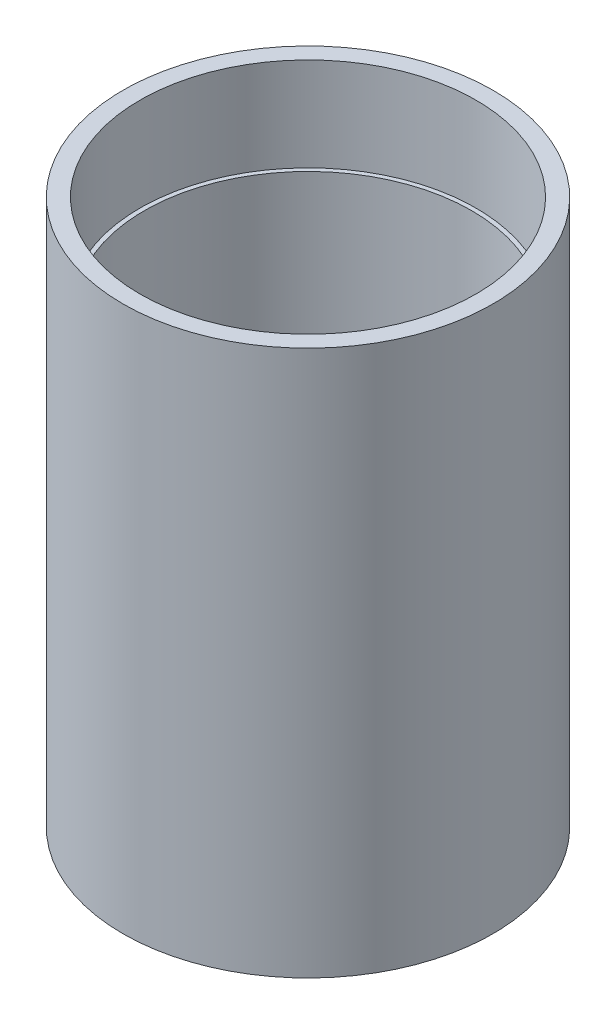
ISO-10303-21;
HEADER;
FILE_DESCRIPTION(('STEP AP214'),'2;1');
FILE_NAME('part.step','',(''),(''),'','','');
FILE_SCHEMA(('AUTOMOTIVE_DESIGN { 1 0 10303 214 1 1 1 1 }'));
ENDSEC;
DATA;
#1=APPLICATION_CONTEXT('core data for automotive mechanical design processes');
#2=APPLICATION_PROTOCOL_DEFINITION('international standard','automotive_design',2000,#1);
#3=PRODUCT_CONTEXT('',#1,'mechanical');
#4=PRODUCT('Part','Part','',(#3));
#5=PRODUCT_RELATED_PRODUCT_CATEGORY('part','',(#4));
#6=PRODUCT_DEFINITION_FORMATION('','',#4);
#7=PRODUCT_DEFINITION_CONTEXT('part definition',#1,'design');
#8=PRODUCT_DEFINITION('design','',#6,#7);
#9=PRODUCT_DEFINITION_SHAPE('','',#8);
#10=(LENGTH_UNIT() NAMED_UNIT(*) SI_UNIT(.MILLI.,.METRE.));
#11=(NAMED_UNIT(*) PLANE_ANGLE_UNIT() SI_UNIT($,.RADIAN.));
#12=(NAMED_UNIT(*) SI_UNIT($,.STERADIAN.) SOLID_ANGLE_UNIT());
#13=UNCERTAINTY_MEASURE_WITH_UNIT(LENGTH_MEASURE(1.E-05),#10,'distance_accuracy_value','');
#14=(GEOMETRIC_REPRESENTATION_CONTEXT(3) GLOBAL_UNCERTAINTY_ASSIGNED_CONTEXT((#13)) GLOBAL_UNIT_ASSIGNED_CONTEXT((#10,
#11,#12)) REPRESENTATION_CONTEXT('',''));
#15=CARTESIAN_POINT('',(0.,0.,0.));
#16=DIRECTION('',(0.,0.,1.));
#17=DIRECTION('',(1.,0.,0.));
#18=AXIS2_PLACEMENT_3D('',#15,#16,#17);
#19=CARTESIAN_POINT('',(0.,73.66,0.));
#20=DIRECTION('',(0.,1.,0.));
#21=DIRECTION('',(0.,0.,1.));
#22=AXIS2_PLACEMENT_3D('',#19,#20,#21);
#23=CYLINDRICAL_SURFACE('',#22,27.3812);
#24=CARTESIAN_POINT('',(0.,88.9,0.));
#25=DIRECTION('',(0.,1.,0.));
#26=DIRECTION('',(0.,0.,1.));
#27=AXIS2_PLACEMENT_3D('',#24,#25,#26);
#28=CIRCLE('',#27,27.3812);
#29=CARTESIAN_POINT('',(0.,88.9,27.3812));
#30=VERTEX_POINT('',#29);
#31=EDGE_CURVE('E41',#30,#30,#28,.F.);
#32=ORIENTED_EDGE('',*,*,#31,.F.);
#33=EDGE_LOOP('',(#32));
#34=FACE_BOUND('',#33,.T.);
#35=CARTESIAN_POINT('',(0.,73.66,0.));
#36=DIRECTION('',(0.,1.,0.));
#37=DIRECTION('',(0.,0.,1.));
#38=AXIS2_PLACEMENT_3D('',#35,#36,#37);
#39=CIRCLE('',#38,27.3812);
#40=CARTESIAN_POINT('',(0.,73.66,27.3812));
#41=VERTEX_POINT('',#40);
#42=EDGE_CURVE('E19',#41,#41,#39,.T.);
#43=ORIENTED_EDGE('',*,*,#42,.F.);
#44=EDGE_LOOP('',(#43));
#45=FACE_BOUND('',#44,.T.);
#46=ADVANCED_FACE('F15',(#34,#45),#23,.F.);
#47=CARTESIAN_POINT('',(-27.7097744,73.66,-27.7097744));
#48=DIRECTION('',(0.,1.,0.));
#49=DIRECTION('',(0.,0.,1.));
#50=AXIS2_PLACEMENT_3D('',#47,#48,#49);
#51=PLANE('',#50);
#52=CARTESIAN_POINT('',(0.,73.66,0.));
#53=DIRECTION('',(0.,1.,0.));
#54=DIRECTION('',(0.,0.,1.));
#55=AXIS2_PLACEMENT_3D('',#52,#53,#54);
#56=CIRCLE('',#55,26.67);
#57=CARTESIAN_POINT('',(0.,73.66,26.67));
#58=VERTEX_POINT('',#57);
#59=EDGE_CURVE('E39',#58,#58,#56,.T.);
#60=ORIENTED_EDGE('',*,*,#59,.F.);
#61=EDGE_LOOP('',(#60));
#62=FACE_BOUND('',#61,.T.);
#63=ORIENTED_EDGE('',*,*,#42,.T.);
#64=EDGE_LOOP('',(#63));
#65=FACE_BOUND('',#64,.T.);
#66=ADVANCED_FACE('F48',(#62,#65),#51,.T.);
#67=CARTESIAN_POINT('',(-30.52445,88.9,-30.52445));
#68=DIRECTION('',(0.,1.,0.));
#69=DIRECTION('',(0.,0.,1.));
#70=AXIS2_PLACEMENT_3D('',#67,#68,#69);
#71=PLANE('',#70);
#72=ORIENTED_EDGE('',*,*,#31,.T.);
#73=EDGE_LOOP('',(#72));
#74=FACE_BOUND('',#73,.T.);
#75=CARTESIAN_POINT('',(0.,88.9,0.));
#76=DIRECTION('',(0.,-1.,0.));
#77=DIRECTION('',(0.,0.,-1.));
#78=AXIS2_PLACEMENT_3D('',#75,#76,#77);
#79=CIRCLE('',#78,30.1625);
#80=CARTESIAN_POINT('',(0.,88.9,-30.1625));
#81=VERTEX_POINT('',#80);
#82=EDGE_CURVE('E36',#81,#81,#79,.F.);
#83=ORIENTED_EDGE('',*,*,#82,.T.);
#84=EDGE_LOOP('',(#83));
#85=FACE_BOUND('',#84,.T.);
#86=ADVANCED_FACE('F57',(#74,#85),#71,.T.);
#87=CARTESIAN_POINT('',(0.,15.24,0.));
#88=DIRECTION('',(0.,1.,0.));
#89=DIRECTION('',(0.,0.,1.));
#90=AXIS2_PLACEMENT_3D('',#87,#88,#89);
#91=CYLINDRICAL_SURFACE('',#90,26.67);
#92=ORIENTED_EDGE('',*,*,#59,.T.);
#93=EDGE_LOOP('',(#92));
#94=FACE_BOUND('',#93,.T.);
#95=CARTESIAN_POINT('',(0.,15.24,0.));
#96=DIRECTION('',(0.,1.,0.));
#97=DIRECTION('',(0.,0.,1.));
#98=AXIS2_PLACEMENT_3D('',#95,#96,#97);
#99=CIRCLE('',#98,26.67);
#100=CARTESIAN_POINT('',(0.,15.24,26.67));
#101=VERTEX_POINT('',#100);
#102=EDGE_CURVE('E33',#101,#101,#99,.T.);
#103=ORIENTED_EDGE('',*,*,#102,.F.);
#104=EDGE_LOOP('',(#103));
#105=FACE_BOUND('',#104,.T.);
#106=ADVANCED_FACE('F73',(#94,#105),#91,.F.);
#107=CARTESIAN_POINT('',(0.,88.9,0.));
#108=DIRECTION('',(0.,-1.,0.));
#109=DIRECTION('',(0.,0.,-1.));
#110=AXIS2_PLACEMENT_3D('',#107,#108,#109);
#111=CYLINDRICAL_SURFACE('',#110,30.1625);
#112=ORIENTED_EDGE('',*,*,#82,.F.);
#113=EDGE_LOOP('',(#112));
#114=FACE_BOUND('',#113,.T.);
#115=CARTESIAN_POINT('',(0.,0.,0.));
#116=DIRECTION('',(0.,-1.,0.));
#117=DIRECTION('',(0.,0.,-1.));
#118=AXIS2_PLACEMENT_3D('',#115,#116,#117);
#119=CIRCLE('',#118,30.1625);
#120=CARTESIAN_POINT('',(0.,0.,-30.1625));
#121=VERTEX_POINT('',#120);
#122=EDGE_CURVE('E28',#121,#121,#119,.F.);
#123=ORIENTED_EDGE('',*,*,#122,.T.);
#124=EDGE_LOOP('',(#123));
#125=FACE_BOUND('',#124,.T.);
#126=ADVANCED_FACE('F71',(#114,#125),#111,.T.);
#127=CARTESIAN_POINT('',(-27.7097744,15.24,27.7097744));
#128=DIRECTION('',(0.,-1.,0.));
#129=DIRECTION('',(0.,0.,-1.));
#130=AXIS2_PLACEMENT_3D('',#127,#128,#129);
#131=PLANE('',#130);
#132=ORIENTED_EDGE('',*,*,#102,.T.);
#133=EDGE_LOOP('',(#132));
#134=FACE_BOUND('',#133,.T.);
#135=CARTESIAN_POINT('',(0.,15.24,0.));
#136=DIRECTION('',(0.,-1.,0.));
#137=DIRECTION('',(0.,0.,-1.));
#138=AXIS2_PLACEMENT_3D('',#135,#136,#137);
#139=CIRCLE('',#138,27.3812);
#140=CARTESIAN_POINT('',(0.,15.24,-27.3812));
#141=VERTEX_POINT('',#140);
#142=EDGE_CURVE('E23',#141,#141,#139,.F.);
#143=ORIENTED_EDGE('',*,*,#142,.F.);
#144=EDGE_LOOP('',(#143));
#145=FACE_BOUND('',#144,.T.);
#146=ADVANCED_FACE('F67',(#134,#145),#131,.T.);
#147=CARTESIAN_POINT('',(-30.52445,0.,-30.52445));
#148=DIRECTION('',(0.,1.,0.));
#149=DIRECTION('',(0.,0.,1.));
#150=AXIS2_PLACEMENT_3D('',#147,#148,#149);
#151=PLANE('',#150);
#152=CARTESIAN_POINT('',(0.,0.,0.));
#153=DIRECTION('',(0.,-1.,0.));
#154=DIRECTION('',(0.,0.,-1.));
#155=AXIS2_PLACEMENT_3D('',#152,#153,#154);
#156=CIRCLE('',#155,27.3812);
#157=CARTESIAN_POINT('',(0.,0.,-27.3812));
#158=VERTEX_POINT('',#157);
#159=EDGE_CURVE('E10',#158,#158,#156,.T.);
#160=ORIENTED_EDGE('',*,*,#159,.F.);
#161=EDGE_LOOP('',(#160));
#162=FACE_BOUND('',#161,.T.);
#163=ORIENTED_EDGE('',*,*,#122,.F.);
#164=EDGE_LOOP('',(#163));
#165=FACE_BOUND('',#164,.T.);
#166=ADVANCED_FACE('F17',(#162,#165),#151,.F.);
#167=CARTESIAN_POINT('',(0.,15.24,0.));
#168=DIRECTION('',(0.,-1.,0.));
#169=DIRECTION('',(0.,0.,-1.));
#170=AXIS2_PLACEMENT_3D('',#167,#168,#169);
#171=CYLINDRICAL_SURFACE('',#170,27.3812);
#172=ORIENTED_EDGE('',*,*,#159,.T.);
#173=EDGE_LOOP('',(#172));
#174=FACE_BOUND('',#173,.T.);
#175=ORIENTED_EDGE('',*,*,#142,.T.);
#176=EDGE_LOOP('',(#175));
#177=FACE_BOUND('',#176,.T.);
#178=ADVANCED_FACE('F61',(#174,#177),#171,.F.);
#179=CLOSED_SHELL('',(#46,#66,#86,#106,#126,#146,#166,#178));
#180=MANIFOLD_SOLID_BREP('B1',#179);
#181=ADVANCED_BREP_SHAPE_REPRESENTATION('',(#18,#180),#14);
#182=SHAPE_DEFINITION_REPRESENTATION(#9,#181);
ENDSEC;
END-ISO-10303-21;
